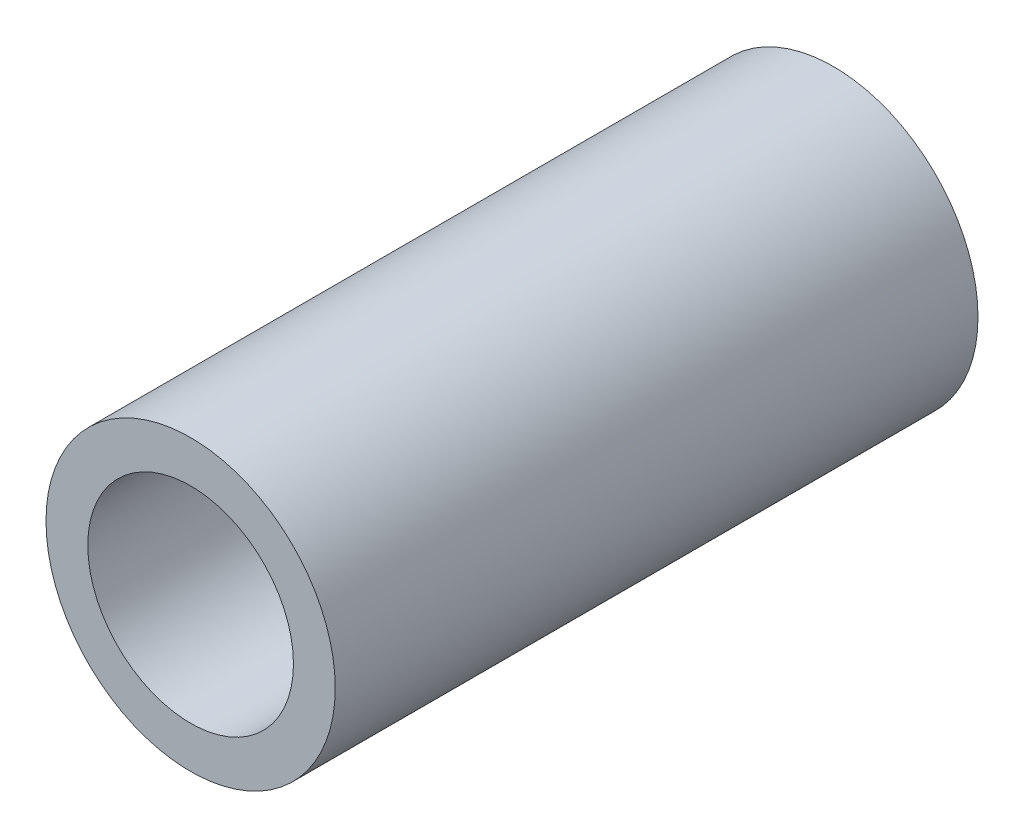
ISO-10303-21;
HEADER;
FILE_DESCRIPTION(('STEP AP214'),'2;1');
FILE_NAME('part.step','',(''),(''),'','','');
FILE_SCHEMA(('AUTOMOTIVE_DESIGN { 1 0 10303 214 1 1 1 1 }'));
ENDSEC;
DATA;
#1=APPLICATION_CONTEXT('core data for automotive mechanical design processes');
#2=APPLICATION_PROTOCOL_DEFINITION('international standard','automotive_design',2000,#1);
#3=PRODUCT_CONTEXT('',#1,'mechanical');
#4=PRODUCT('Part','Part','',(#3));
#5=PRODUCT_RELATED_PRODUCT_CATEGORY('part','',(#4));
#6=PRODUCT_DEFINITION_FORMATION('','',#4);
#7=PRODUCT_DEFINITION_CONTEXT('part definition',#1,'design');
#8=PRODUCT_DEFINITION('design','',#6,#7);
#9=PRODUCT_DEFINITION_SHAPE('','',#8);
#10=(LENGTH_UNIT() NAMED_UNIT(*) SI_UNIT(.MILLI.,.METRE.));
#11=(NAMED_UNIT(*) PLANE_ANGLE_UNIT() SI_UNIT($,.RADIAN.));
#12=(NAMED_UNIT(*) SI_UNIT($,.STERADIAN.) SOLID_ANGLE_UNIT());
#13=UNCERTAINTY_MEASURE_WITH_UNIT(LENGTH_MEASURE(1.E-05),#10,'distance_accuracy_value','');
#14=(GEOMETRIC_REPRESENTATION_CONTEXT(3) GLOBAL_UNCERTAINTY_ASSIGNED_CONTEXT((#13)) GLOBAL_UNIT_ASSIGNED_CONTEXT((#10,
#11,#12)) REPRESENTATION_CONTEXT('',''));
#15=CARTESIAN_POINT('',(0.,0.,0.));
#16=DIRECTION('',(0.,0.,1.));
#17=DIRECTION('',(1.,0.,0.));
#18=AXIS2_PLACEMENT_3D('',#15,#16,#17);
#19=CARTESIAN_POINT('',(0.,0.,5.));
#20=DIRECTION('',(0.,0.,-1.));
#21=DIRECTION('',(-1.,0.,0.));
#22=AXIS2_PLACEMENT_3D('',#19,#20,#21);
#23=CYLINDRICAL_SURFACE('',#22,1.6);
#24=CARTESIAN_POINT('',(0.,0.,5.));
#25=DIRECTION('',(0.,0.,1.));
#26=DIRECTION('',(1.,0.,0.));
#27=AXIS2_PLACEMENT_3D('',#24,#25,#26);
#28=CIRCLE('',#27,1.6);
#29=CARTESIAN_POINT('',(-1.6,0.,5.));
#30=VERTEX_POINT('',#29);
#31=CARTESIAN_POINT('',(1.6,0.,5.));
#32=VERTEX_POINT('',#31);
#33=EDGE_CURVE('E10',#30,#32,#28,.T.);
#34=ORIENTED_EDGE('',*,*,#33,.T.);
#35=DIRECTION('',(0.,0.,-1.));
#36=VECTOR('',#35,1.);
#37=CARTESIAN_POINT('',(1.6,0.,5.));
#38=LINE('',#37,#36);
#39=CARTESIAN_POINT('',(1.6,0.,-5.));
#40=VERTEX_POINT('',#39);
#41=EDGE_CURVE('E27',#32,#40,#38,.T.);
#42=ORIENTED_EDGE('',*,*,#41,.T.);
#43=CARTESIAN_POINT('',(0.,0.,-5.));
#44=DIRECTION('',(0.,0.,1.));
#45=DIRECTION('',(1.,0.,0.));
#46=AXIS2_PLACEMENT_3D('',#43,#44,#45);
#47=CIRCLE('',#46,1.6);
#48=CARTESIAN_POINT('',(-1.6,0.,-5.));
#49=VERTEX_POINT('',#48);
#50=EDGE_CURVE('E85',#49,#40,#47,.T.);
#51=ORIENTED_EDGE('',*,*,#50,.F.);
#52=CARTESIAN_POINT('',(0.,0.,-5.));
#53=DIRECTION('',(0.,0.,1.));
#54=DIRECTION('',(1.,0.,0.));
#55=AXIS2_PLACEMENT_3D('',#52,#53,#54);
#56=CIRCLE('',#55,1.6);
#57=EDGE_CURVE('E90',#40,#49,#56,.T.);
#58=ORIENTED_EDGE('',*,*,#57,.F.);
#59=ORIENTED_EDGE('',*,*,#41,.F.);
#60=CARTESIAN_POINT('',(0.,0.,5.));
#61=DIRECTION('',(0.,0.,1.));
#62=DIRECTION('',(1.,0.,0.));
#63=AXIS2_PLACEMENT_3D('',#60,#61,#62);
#64=CIRCLE('',#63,1.6);
#65=EDGE_CURVE('E101',#32,#30,#64,.T.);
#66=ORIENTED_EDGE('',*,*,#65,.T.);
#67=EDGE_LOOP('',(#34,#42,#51,#58,#59,#66));
#68=FACE_BOUND('',#67,.T.);
#69=ADVANCED_FACE('F16',(#68),#23,.F.);
#70=CARTESIAN_POINT('',(0.,0.,5.));
#71=DIRECTION('',(0.,0.,-1.));
#72=DIRECTION('',(-1.,0.,0.));
#73=AXIS2_PLACEMENT_3D('',#70,#71,#72);
#74=CYLINDRICAL_SURFACE('',#73,2.25);
#75=CARTESIAN_POINT('',(0.,0.,-5.));
#76=DIRECTION('',(0.,0.,1.));
#77=DIRECTION('',(1.,0.,0.));
#78=AXIS2_PLACEMENT_3D('',#75,#76,#77);
#79=CIRCLE('',#78,2.25);
#80=CARTESIAN_POINT('',(-2.25,0.,-5.));
#81=VERTEX_POINT('',#80);
#82=CARTESIAN_POINT('',(2.25,0.,-5.));
#83=VERTEX_POINT('',#82);
#84=EDGE_CURVE('E81',#81,#83,#79,.T.);
#85=ORIENTED_EDGE('',*,*,#84,.T.);
#86=DIRECTION('',(0.,0.,1.));
#87=VECTOR('',#86,1.);
#88=CARTESIAN_POINT('',(2.25,0.,5.));
#89=LINE('',#88,#87);
#90=CARTESIAN_POINT('',(2.25,0.,5.));
#91=VERTEX_POINT('',#90);
#92=EDGE_CURVE('E65',#83,#91,#89,.T.);
#93=ORIENTED_EDGE('',*,*,#92,.T.);
#94=CARTESIAN_POINT('',(0.,0.,5.));
#95=DIRECTION('',(0.,0.,1.));
#96=DIRECTION('',(1.,0.,0.));
#97=AXIS2_PLACEMENT_3D('',#94,#95,#96);
#98=CIRCLE('',#97,2.25);
#99=CARTESIAN_POINT('',(-2.25,0.,5.));
#100=VERTEX_POINT('',#99);
#101=EDGE_CURVE('E74',#100,#91,#98,.T.);
#102=ORIENTED_EDGE('',*,*,#101,.F.);
#103=CARTESIAN_POINT('',(0.,0.,5.));
#104=DIRECTION('',(0.,0.,1.));
#105=DIRECTION('',(1.,0.,0.));
#106=AXIS2_PLACEMENT_3D('',#103,#104,#105);
#107=CIRCLE('',#106,2.25);
#108=EDGE_CURVE('E20',#91,#100,#107,.T.);
#109=ORIENTED_EDGE('',*,*,#108,.F.);
#110=ORIENTED_EDGE('',*,*,#92,.F.);
#111=CARTESIAN_POINT('',(0.,0.,-5.));
#112=DIRECTION('',(0.,0.,1.));
#113=DIRECTION('',(1.,0.,0.));
#114=AXIS2_PLACEMENT_3D('',#111,#112,#113);
#115=CIRCLE('',#114,2.25);
#116=EDGE_CURVE('E78',#83,#81,#115,.T.);
#117=ORIENTED_EDGE('',*,*,#116,.T.);
#118=EDGE_LOOP('',(#85,#93,#102,#109,#110,#117));
#119=FACE_BOUND('',#118,.T.);
#120=ADVANCED_FACE('F80',(#119),#74,.T.);
#121=CARTESIAN_POINT('',(0.,0.,5.));
#122=DIRECTION('',(0.,0.,1.));
#123=DIRECTION('',(1.,0.,0.));
#124=AXIS2_PLACEMENT_3D('',#121,#122,#123);
#125=PLANE('',#124);
#126=ORIENTED_EDGE('',*,*,#101,.T.);
#127=ORIENTED_EDGE('',*,*,#108,.T.);
#128=EDGE_LOOP('',(#126,#127));
#129=FACE_BOUND('',#128,.T.);
#130=ORIENTED_EDGE('',*,*,#33,.F.);
#131=ORIENTED_EDGE('',*,*,#65,.F.);
#132=EDGE_LOOP('',(#130,#131));
#133=FACE_BOUND('',#132,.T.);
#134=ADVANCED_FACE('F75',(#129,#133),#125,.T.);
#135=CARTESIAN_POINT('',(0.,0.,-5.));
#136=DIRECTION('',(0.,0.,1.));
#137=DIRECTION('',(1.,0.,0.));
#138=AXIS2_PLACEMENT_3D('',#135,#136,#137);
#139=PLANE('',#138);
#140=ORIENTED_EDGE('',*,*,#84,.F.);
#141=ORIENTED_EDGE('',*,*,#116,.F.);
#142=EDGE_LOOP('',(#140,#141));
#143=FACE_BOUND('',#142,.T.);
#144=ORIENTED_EDGE('',*,*,#50,.T.);
#145=ORIENTED_EDGE('',*,*,#57,.T.);
#146=EDGE_LOOP('',(#144,#145));
#147=FACE_BOUND('',#146,.T.);
#148=ADVANCED_FACE('F18',(#143,#147),#139,.F.);
#149=CLOSED_SHELL('',(#69,#120,#134,#148));
#150=MANIFOLD_SOLID_BREP('B1',#149);
#151=ADVANCED_BREP_SHAPE_REPRESENTATION('',(#18,#150),#14);
#152=SHAPE_DEFINITION_REPRESENTATION(#9,#151);
ENDSEC;
END-ISO-10303-21;
